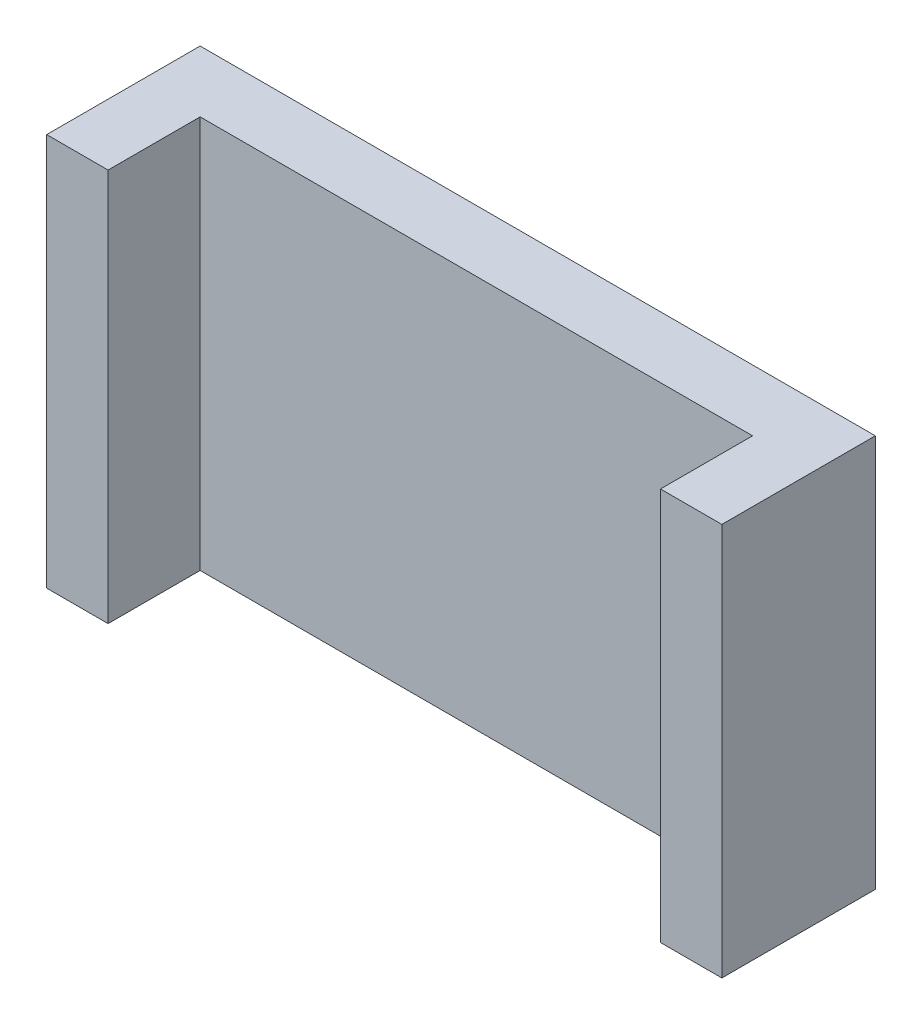
ISO-10303-21;
HEADER;
FILE_DESCRIPTION(('STEP AP214'),'2;1');
FILE_NAME('part.step','',(''),(''),'','','');
FILE_SCHEMA(('AUTOMOTIVE_DESIGN { 1 0 10303 214 1 1 1 1 }'));
ENDSEC;
DATA;
#1=APPLICATION_CONTEXT('core data for automotive mechanical design processes');
#2=APPLICATION_PROTOCOL_DEFINITION('international standard','automotive_design',2000,#1);
#3=PRODUCT_CONTEXT('',#1,'mechanical');
#4=PRODUCT('Part','Part','',(#3));
#5=PRODUCT_RELATED_PRODUCT_CATEGORY('part','',(#4));
#6=PRODUCT_DEFINITION_FORMATION('','',#4);
#7=PRODUCT_DEFINITION_CONTEXT('part definition',#1,'design');
#8=PRODUCT_DEFINITION('design','',#6,#7);
#9=PRODUCT_DEFINITION_SHAPE('','',#8);
#10=(LENGTH_UNIT() NAMED_UNIT(*) SI_UNIT(.MILLI.,.METRE.));
#11=(NAMED_UNIT(*) PLANE_ANGLE_UNIT() SI_UNIT($,.RADIAN.));
#12=(NAMED_UNIT(*) SI_UNIT($,.STERADIAN.) SOLID_ANGLE_UNIT());
#13=UNCERTAINTY_MEASURE_WITH_UNIT(LENGTH_MEASURE(1.E-05),#10,'distance_accuracy_value','');
#14=(GEOMETRIC_REPRESENTATION_CONTEXT(3) GLOBAL_UNCERTAINTY_ASSIGNED_CONTEXT((#13)) GLOBAL_UNIT_ASSIGNED_CONTEXT((#10,
#11,#12)) REPRESENTATION_CONTEXT('',''));
#15=CARTESIAN_POINT('',(0.,0.,0.));
#16=DIRECTION('',(0.,0.,1.));
#17=DIRECTION('',(1.,0.,0.));
#18=AXIS2_PLACEMENT_3D('',#15,#16,#17);
#19=CARTESIAN_POINT('',(0.,0.,5.));
#20=DIRECTION('',(0.,0.,-1.));
#21=DIRECTION('',(-1.,0.,0.));
#22=AXIS2_PLACEMENT_3D('',#19,#20,#21);
#23=PLANE('',#22);
#24=DIRECTION('',(0.,-1.,0.));
#25=VECTOR('',#24,1.);
#26=CARTESIAN_POINT('',(50.,32.,5.));
#27=LINE('',#26,#25);
#28=CARTESIAN_POINT('',(50.,32.,5.));
#29=VERTEX_POINT('',#28);
#30=CARTESIAN_POINT('',(50.,0.,5.));
#31=VERTEX_POINT('',#30);
#32=EDGE_CURVE('E64',#29,#31,#27,.T.);
#33=ORIENTED_EDGE('',*,*,#32,.F.);
#34=DIRECTION('',(1.,0.,0.));
#35=VECTOR('',#34,1.);
#36=CARTESIAN_POINT('',(0.,32.,5.));
#37=LINE('',#36,#35);
#38=CARTESIAN_POINT('',(5.,32.,5.));
#39=VERTEX_POINT('',#38);
#40=EDGE_CURVE('E169',#39,#29,#37,.T.);
#41=ORIENTED_EDGE('',*,*,#40,.F.);
#42=DIRECTION('',(0.,-1.,0.));
#43=VECTOR('',#42,1.);
#44=CARTESIAN_POINT('',(5.,0.,5.));
#45=LINE('',#44,#43);
#46=CARTESIAN_POINT('',(5.,0.,5.));
#47=VERTEX_POINT('',#46);
#48=EDGE_CURVE('E140',#39,#47,#45,.T.);
#49=ORIENTED_EDGE('',*,*,#48,.T.);
#50=DIRECTION('',(1.,0.,0.));
#51=VECTOR('',#50,1.);
#52=CARTESIAN_POINT('',(0.,0.,5.));
#53=LINE('',#52,#51);
#54=EDGE_CURVE('E59',#47,#31,#53,.T.);
#55=ORIENTED_EDGE('',*,*,#54,.T.);
#56=EDGE_LOOP('',(#33,#41,#49,#55));
#57=FACE_BOUND('',#56,.T.);
#58=ADVANCED_FACE('F41',(#57),#23,.F.);
#59=CARTESIAN_POINT('',(0.,0.,5.));
#60=DIRECTION('',(-1.,0.,0.));
#61=DIRECTION('',(0.,0.,1.));
#62=AXIS2_PLACEMENT_3D('',#59,#60,#61);
#63=PLANE('',#62);
#64=DIRECTION('',(0.,1.,0.));
#65=VECTOR('',#64,1.);
#66=CARTESIAN_POINT('',(0.,0.,0.));
#67=LINE('',#66,#65);
#68=CARTESIAN_POINT('',(0.,0.,0.));
#69=VERTEX_POINT('',#68);
#70=CARTESIAN_POINT('',(0.,32.,0.));
#71=VERTEX_POINT('',#70);
#72=EDGE_CURVE('E168',#69,#71,#67,.T.);
#73=ORIENTED_EDGE('',*,*,#72,.F.);
#74=DIRECTION('',(0.,0.,-1.));
#75=VECTOR('',#74,1.);
#76=CARTESIAN_POINT('',(0.,0.,5.));
#77=LINE('',#76,#75);
#78=CARTESIAN_POINT('',(0.,0.,12.5));
#79=VERTEX_POINT('',#78);
#80=EDGE_CURVE('E11',#79,#69,#77,.T.);
#81=ORIENTED_EDGE('',*,*,#80,.F.);
#82=DIRECTION('',(0.,-1.,0.));
#83=VECTOR('',#82,1.);
#84=CARTESIAN_POINT('',(0.,0.,12.5));
#85=LINE('',#84,#83);
#86=CARTESIAN_POINT('',(0.,32.,12.5));
#87=VERTEX_POINT('',#86);
#88=EDGE_CURVE('E153',#87,#79,#85,.T.);
#89=ORIENTED_EDGE('',*,*,#88,.F.);
#90=DIRECTION('',(0.,0.,-1.));
#91=VECTOR('',#90,1.);
#92=CARTESIAN_POINT('',(0.,32.,5.));
#93=LINE('',#92,#91);
#94=EDGE_CURVE('E45',#87,#71,#93,.T.);
#95=ORIENTED_EDGE('',*,*,#94,.T.);
#96=EDGE_LOOP('',(#73,#81,#89,#95));
#97=FACE_BOUND('',#96,.T.);
#98=ADVANCED_FACE('F43',(#97),#63,.T.);
#99=CARTESIAN_POINT('',(0.,0.,5.));
#100=DIRECTION('',(0.,1.,0.));
#101=DIRECTION('',(0.,0.,1.));
#102=AXIS2_PLACEMENT_3D('',#99,#100,#101);
#103=PLANE('',#102);
#104=DIRECTION('',(1.,0.,0.));
#105=VECTOR('',#104,1.);
#106=CARTESIAN_POINT('',(0.,0.,0.));
#107=LINE('',#106,#105);
#108=CARTESIAN_POINT('',(55.,0.,0.));
#109=VERTEX_POINT('',#108);
#110=EDGE_CURVE('E172',#69,#109,#107,.T.);
#111=ORIENTED_EDGE('',*,*,#110,.T.);
#112=DIRECTION('',(0.,0.,-1.));
#113=VECTOR('',#112,1.);
#114=CARTESIAN_POINT('',(55.,0.,5.));
#115=LINE('',#114,#113);
#116=CARTESIAN_POINT('',(55.,0.,12.5));
#117=VERTEX_POINT('',#116);
#118=EDGE_CURVE('E51',#117,#109,#115,.T.);
#119=ORIENTED_EDGE('',*,*,#118,.F.);
#120=DIRECTION('',(-1.,0.,0.));
#121=VECTOR('',#120,1.);
#122=CARTESIAN_POINT('',(55.,0.,12.5));
#123=LINE('',#122,#121);
#124=CARTESIAN_POINT('',(50.,0.,12.5));
#125=VERTEX_POINT('',#124);
#126=EDGE_CURVE('E135',#117,#125,#123,.T.);
#127=ORIENTED_EDGE('',*,*,#126,.T.);
#128=DIRECTION('',(0.,0.,-1.));
#129=VECTOR('',#128,1.);
#130=CARTESIAN_POINT('',(50.,0.,12.5));
#131=LINE('',#130,#129);
#132=EDGE_CURVE('E130',#125,#31,#131,.T.);
#133=ORIENTED_EDGE('',*,*,#132,.T.);
#134=ORIENTED_EDGE('',*,*,#54,.F.);
#135=DIRECTION('',(0.,0.,-1.));
#136=VECTOR('',#135,1.);
#137=CARTESIAN_POINT('',(5.,0.,12.5));
#138=LINE('',#137,#136);
#139=CARTESIAN_POINT('',(5.,0.,12.5));
#140=VERTEX_POINT('',#139);
#141=EDGE_CURVE('E160',#140,#47,#138,.T.);
#142=ORIENTED_EDGE('',*,*,#141,.F.);
#143=DIRECTION('',(1.,0.,0.));
#144=VECTOR('',#143,1.);
#145=CARTESIAN_POINT('',(0.,0.,12.5));
#146=LINE('',#145,#144);
#147=EDGE_CURVE('E157',#79,#140,#146,.T.);
#148=ORIENTED_EDGE('',*,*,#147,.F.);
#149=ORIENTED_EDGE('',*,*,#80,.T.);
#150=EDGE_LOOP('',(#111,#119,#127,#133,#134,#142,#148,#149));
#151=FACE_BOUND('',#150,.T.);
#152=ADVANCED_FACE('F199',(#151),#103,.F.);
#153=CARTESIAN_POINT('',(55.,0.,5.));
#154=DIRECTION('',(-1.,0.,0.));
#155=DIRECTION('',(0.,0.,1.));
#156=AXIS2_PLACEMENT_3D('',#153,#154,#155);
#157=PLANE('',#156);
#158=DIRECTION('',(0.,1.,0.));
#159=VECTOR('',#158,1.);
#160=CARTESIAN_POINT('',(55.,0.,0.));
#161=LINE('',#160,#159);
#162=CARTESIAN_POINT('',(55.,32.,0.));
#163=VERTEX_POINT('',#162);
#164=EDGE_CURVE('E116',#109,#163,#161,.T.);
#165=ORIENTED_EDGE('',*,*,#164,.T.);
#166=DIRECTION('',(0.,0.,-1.));
#167=VECTOR('',#166,1.);
#168=CARTESIAN_POINT('',(55.,32.,5.));
#169=LINE('',#168,#167);
#170=CARTESIAN_POINT('',(55.,32.,12.5));
#171=VERTEX_POINT('',#170);
#172=EDGE_CURVE('E109',#171,#163,#169,.T.);
#173=ORIENTED_EDGE('',*,*,#172,.F.);
#174=DIRECTION('',(0.,-1.,0.));
#175=VECTOR('',#174,1.);
#176=CARTESIAN_POINT('',(55.,32.,12.5));
#177=LINE('',#176,#175);
#178=EDGE_CURVE('E114',#171,#117,#177,.T.);
#179=ORIENTED_EDGE('',*,*,#178,.T.);
#180=ORIENTED_EDGE('',*,*,#118,.T.);
#181=EDGE_LOOP('',(#165,#173,#179,#180));
#182=FACE_BOUND('',#181,.T.);
#183=ADVANCED_FACE('F111',(#182),#157,.F.);
#184=CARTESIAN_POINT('',(0.,32.,5.));
#185=DIRECTION('',(0.,1.,0.));
#186=DIRECTION('',(0.,0.,1.));
#187=AXIS2_PLACEMENT_3D('',#184,#185,#186);
#188=PLANE('',#187);
#189=DIRECTION('',(1.,0.,0.));
#190=VECTOR('',#189,1.);
#191=CARTESIAN_POINT('',(0.,32.,0.));
#192=LINE('',#191,#190);
#193=EDGE_CURVE('E178',#71,#163,#192,.T.);
#194=ORIENTED_EDGE('',*,*,#193,.F.);
#195=ORIENTED_EDGE('',*,*,#94,.F.);
#196=DIRECTION('',(-1.,0.,0.));
#197=VECTOR('',#196,1.);
#198=CARTESIAN_POINT('',(0.,32.,12.5));
#199=LINE('',#198,#197);
#200=CARTESIAN_POINT('',(5.,32.,12.5));
#201=VERTEX_POINT('',#200);
#202=EDGE_CURVE('E149',#201,#87,#199,.T.);
#203=ORIENTED_EDGE('',*,*,#202,.F.);
#204=DIRECTION('',(0.,0.,-1.));
#205=VECTOR('',#204,1.);
#206=CARTESIAN_POINT('',(5.,32.,12.5));
#207=LINE('',#206,#205);
#208=EDGE_CURVE('E165',#201,#39,#207,.T.);
#209=ORIENTED_EDGE('',*,*,#208,.T.);
#210=ORIENTED_EDGE('',*,*,#40,.T.);
#211=DIRECTION('',(0.,0.,-1.));
#212=VECTOR('',#211,1.);
#213=CARTESIAN_POINT('',(50.,32.,12.5));
#214=LINE('',#213,#212);
#215=CARTESIAN_POINT('',(50.,32.,12.5));
#216=VERTEX_POINT('',#215);
#217=EDGE_CURVE('E125',#216,#29,#214,.T.);
#218=ORIENTED_EDGE('',*,*,#217,.F.);
#219=DIRECTION('',(-1.,0.,0.));
#220=VECTOR('',#219,1.);
#221=CARTESIAN_POINT('',(55.,32.,12.5));
#222=LINE('',#221,#220);
#223=EDGE_CURVE('E122',#171,#216,#222,.T.);
#224=ORIENTED_EDGE('',*,*,#223,.F.);
#225=ORIENTED_EDGE('',*,*,#172,.T.);
#226=EDGE_LOOP('',(#194,#195,#203,#209,#210,#218,#224,#225));
#227=FACE_BOUND('',#226,.T.);
#228=ADVANCED_FACE('F123',(#227),#188,.T.);
#229=CARTESIAN_POINT('',(0.,0.,0.));
#230=DIRECTION('',(0.,0.,-1.));
#231=DIRECTION('',(-1.,0.,0.));
#232=AXIS2_PLACEMENT_3D('',#229,#230,#231);
#233=PLANE('',#232);
#234=ORIENTED_EDGE('',*,*,#72,.T.);
#235=ORIENTED_EDGE('',*,*,#193,.T.);
#236=ORIENTED_EDGE('',*,*,#164,.F.);
#237=ORIENTED_EDGE('',*,*,#110,.F.);
#238=EDGE_LOOP('',(#234,#235,#236,#237));
#239=FACE_BOUND('',#238,.T.);
#240=ADVANCED_FACE('F189',(#239),#233,.T.);
#241=CARTESIAN_POINT('',(5.,0.,12.5));
#242=DIRECTION('',(1.,0.,0.));
#243=DIRECTION('',(0.,1.,0.));
#244=AXIS2_PLACEMENT_3D('',#241,#242,#243);
#245=PLANE('',#244);
#246=ORIENTED_EDGE('',*,*,#48,.F.);
#247=ORIENTED_EDGE('',*,*,#208,.F.);
#248=DIRECTION('',(0.,-1.,0.));
#249=VECTOR('',#248,1.);
#250=CARTESIAN_POINT('',(5.,0.,12.5));
#251=LINE('',#250,#249);
#252=EDGE_CURVE('E145',#201,#140,#251,.T.);
#253=ORIENTED_EDGE('',*,*,#252,.T.);
#254=ORIENTED_EDGE('',*,*,#141,.T.);
#255=EDGE_LOOP('',(#246,#247,#253,#254));
#256=FACE_BOUND('',#255,.T.);
#257=ADVANCED_FACE('F203',(#256),#245,.T.);
#258=CARTESIAN_POINT('',(0.,0.,12.5));
#259=DIRECTION('',(0.,0.,1.));
#260=DIRECTION('',(1.,0.,0.));
#261=AXIS2_PLACEMENT_3D('',#258,#259,#260);
#262=PLANE('',#261);
#263=ORIENTED_EDGE('',*,*,#252,.F.);
#264=ORIENTED_EDGE('',*,*,#202,.T.);
#265=ORIENTED_EDGE('',*,*,#88,.T.);
#266=ORIENTED_EDGE('',*,*,#147,.T.);
#267=EDGE_LOOP('',(#263,#264,#265,#266));
#268=FACE_BOUND('',#267,.T.);
#269=ADVANCED_FACE('F197',(#268),#262,.T.);
#270=CARTESIAN_POINT('',(50.,32.,12.5));
#271=DIRECTION('',(1.,0.,0.));
#272=DIRECTION('',(0.,1.,0.));
#273=AXIS2_PLACEMENT_3D('',#270,#271,#272);
#274=PLANE('',#273);
#275=ORIENTED_EDGE('',*,*,#32,.T.);
#276=ORIENTED_EDGE('',*,*,#132,.F.);
#277=DIRECTION('',(0.,-1.,0.));
#278=VECTOR('',#277,1.);
#279=CARTESIAN_POINT('',(50.,32.,12.5));
#280=LINE('',#279,#278);
#281=EDGE_CURVE('E129',#216,#125,#280,.T.);
#282=ORIENTED_EDGE('',*,*,#281,.F.);
#283=ORIENTED_EDGE('',*,*,#217,.T.);
#284=EDGE_LOOP('',(#275,#276,#282,#283));
#285=FACE_BOUND('',#284,.T.);
#286=ADVANCED_FACE('F205',(#285),#274,.F.);
#287=CARTESIAN_POINT('',(0.,0.,12.5));
#288=DIRECTION('',(0.,0.,-1.));
#289=DIRECTION('',(-1.,0.,0.));
#290=AXIS2_PLACEMENT_3D('',#287,#288,#289);
#291=PLANE('',#290);
#292=ORIENTED_EDGE('',*,*,#178,.F.);
#293=ORIENTED_EDGE('',*,*,#223,.T.);
#294=ORIENTED_EDGE('',*,*,#281,.T.);
#295=ORIENTED_EDGE('',*,*,#126,.F.);
#296=EDGE_LOOP('',(#292,#293,#294,#295));
#297=FACE_BOUND('',#296,.T.);
#298=ADVANCED_FACE('F133',(#297),#291,.F.);
#299=CLOSED_SHELL('',(#58,#98,#152,#183,#228,#240,#257,#269,#286,#298));
#300=MANIFOLD_SOLID_BREP('B2',#299);
#301=ADVANCED_BREP_SHAPE_REPRESENTATION('',(#18,#300),#14);
#302=SHAPE_DEFINITION_REPRESENTATION(#9,#301);
ENDSEC;
END-ISO-10303-21;
